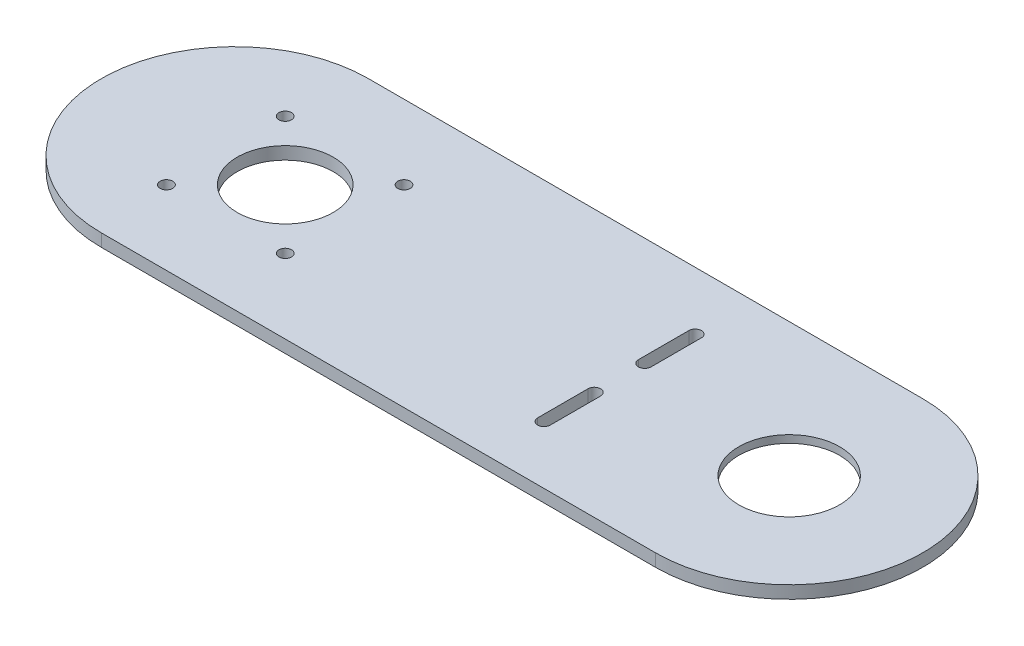
ISO-10303-21;
HEADER;
FILE_DESCRIPTION(('STEP AP214'),'2;1');
FILE_NAME('part.step','',(''),(''),'','','');
FILE_SCHEMA(('AUTOMOTIVE_DESIGN { 1 0 10303 214 1 1 1 1 }'));
ENDSEC;
DATA;
#1=APPLICATION_CONTEXT('core data for automotive mechanical design processes');
#2=APPLICATION_PROTOCOL_DEFINITION('international standard','automotive_design',2000,#1);
#3=PRODUCT_CONTEXT('',#1,'mechanical');
#4=PRODUCT('Part','Part','',(#3));
#5=PRODUCT_RELATED_PRODUCT_CATEGORY('part','',(#4));
#6=PRODUCT_DEFINITION_FORMATION('','',#4);
#7=PRODUCT_DEFINITION_CONTEXT('part definition',#1,'design');
#8=PRODUCT_DEFINITION('design','',#6,#7);
#9=PRODUCT_DEFINITION_SHAPE('','',#8);
#10=(LENGTH_UNIT() NAMED_UNIT(*) SI_UNIT(.MILLI.,.METRE.));
#11=(NAMED_UNIT(*) PLANE_ANGLE_UNIT() SI_UNIT($,.RADIAN.));
#12=(NAMED_UNIT(*) SI_UNIT($,.STERADIAN.) SOLID_ANGLE_UNIT());
#13=UNCERTAINTY_MEASURE_WITH_UNIT(LENGTH_MEASURE(1.E-05),#10,'distance_accuracy_value','');
#14=(GEOMETRIC_REPRESENTATION_CONTEXT(3) GLOBAL_UNCERTAINTY_ASSIGNED_CONTEXT((#13)) GLOBAL_UNIT_ASSIGNED_CONTEXT((#10,
#11,#12)) REPRESENTATION_CONTEXT('',''));
#15=CARTESIAN_POINT('',(0.,0.,0.));
#16=DIRECTION('',(0.,0.,1.));
#17=DIRECTION('',(1.,0.,0.));
#18=AXIS2_PLACEMENT_3D('',#15,#16,#17);
#19=CARTESIAN_POINT('',(110.,0.,0.));
#20=DIRECTION('',(0.,1.,0.));
#21=DIRECTION('',(0.,0.,1.));
#22=AXIS2_PLACEMENT_3D('',#19,#20,#21);
#23=CYLINDRICAL_SURFACE('',#22,20.);
#24=CARTESIAN_POINT('',(110.,5.,0.));
#25=DIRECTION('',(0.,1.,0.));
#26=DIRECTION('',(0.,0.,1.));
#27=AXIS2_PLACEMENT_3D('',#24,#25,#26);
#28=CIRCLE('',#27,20.);
#29=CARTESIAN_POINT('',(110.,5.,20.));
#30=VERTEX_POINT('',#29);
#31=EDGE_CURVE('E207',#30,#30,#28,.T.);
#32=ORIENTED_EDGE('',*,*,#31,.T.);
#33=EDGE_LOOP('',(#32));
#34=FACE_BOUND('',#33,.T.);
#35=CARTESIAN_POINT('',(110.,2.,0.));
#36=DIRECTION('',(0.,-1.,0.));
#37=DIRECTION('',(0.,0.,-1.));
#38=AXIS2_PLACEMENT_3D('',#35,#36,#37);
#39=CIRCLE('',#38,20.);
#40=CARTESIAN_POINT('',(110.,2.,-20.));
#41=VERTEX_POINT('',#40);
#42=EDGE_CURVE('E36',#41,#41,#39,.F.);
#43=ORIENTED_EDGE('',*,*,#42,.F.);
#44=EDGE_LOOP('',(#43));
#45=FACE_BOUND('',#44,.T.);
#46=ADVANCED_FACE('F32',(#34,#45),#23,.F.);
#47=CARTESIAN_POINT('',(-110.,5.,0.));
#48=DIRECTION('',(0.,-1.,0.));
#49=DIRECTION('',(0.,0.,-1.));
#50=AXIS2_PLACEMENT_3D('',#47,#48,#49);
#51=CYLINDRICAL_SURFACE('',#50,53.);
#52=CARTESIAN_POINT('',(-110.,0.,0.));
#53=DIRECTION('',(0.,1.,0.));
#54=DIRECTION('',(0.,0.,1.));
#55=AXIS2_PLACEMENT_3D('',#52,#53,#54);
#56=CIRCLE('',#55,53.);
#57=CARTESIAN_POINT('',(-110.,0.,-53.));
#58=VERTEX_POINT('',#57);
#59=CARTESIAN_POINT('',(-110.,0.,53.));
#60=VERTEX_POINT('',#59);
#61=EDGE_CURVE('E210',#58,#60,#56,.T.);
#62=ORIENTED_EDGE('',*,*,#61,.T.);
#63=DIRECTION('',(0.,-1.,0.));
#64=VECTOR('',#63,1.);
#65=CARTESIAN_POINT('',(-110.,5.,53.));
#66=LINE('',#65,#64);
#67=CARTESIAN_POINT('',(-110.,5.,53.));
#68=VERTEX_POINT('',#67);
#69=EDGE_CURVE('E11',#68,#60,#66,.T.);
#70=ORIENTED_EDGE('',*,*,#69,.F.);
#71=CARTESIAN_POINT('',(-110.,5.,0.));
#72=DIRECTION('',(0.,1.,0.));
#73=DIRECTION('',(0.,0.,1.));
#74=AXIS2_PLACEMENT_3D('',#71,#72,#73);
#75=CIRCLE('',#74,53.);
#76=CARTESIAN_POINT('',(-110.,5.,-53.));
#77=VERTEX_POINT('',#76);
#78=EDGE_CURVE('E211',#77,#68,#75,.T.);
#79=ORIENTED_EDGE('',*,*,#78,.F.);
#80=DIRECTION('',(0.,-1.,0.));
#81=VECTOR('',#80,1.);
#82=CARTESIAN_POINT('',(-110.,5.,-53.));
#83=LINE('',#82,#81);
#84=EDGE_CURVE('E222',#77,#58,#83,.T.);
#85=ORIENTED_EDGE('',*,*,#84,.T.);
#86=EDGE_LOOP('',(#62,#70,#79,#85));
#87=FACE_BOUND('',#86,.T.);
#88=ADVANCED_FACE('F34',(#87),#51,.T.);
#89=CARTESIAN_POINT('',(0.,5.,53.));
#90=DIRECTION('',(0.,0.,-1.));
#91=DIRECTION('',(-1.,0.,0.));
#92=AXIS2_PLACEMENT_3D('',#89,#90,#91);
#93=PLANE('',#92);
#94=DIRECTION('',(1.,0.,0.));
#95=VECTOR('',#94,1.);
#96=CARTESIAN_POINT('',(0.,0.,53.));
#97=LINE('',#96,#95);
#98=CARTESIAN_POINT('',(110.,0.,53.));
#99=VERTEX_POINT('',#98);
#100=EDGE_CURVE('E225',#60,#99,#97,.T.);
#101=ORIENTED_EDGE('',*,*,#100,.T.);
#102=DIRECTION('',(0.,-1.,0.));
#103=VECTOR('',#102,1.);
#104=CARTESIAN_POINT('',(110.,5.,53.));
#105=LINE('',#104,#103);
#106=CARTESIAN_POINT('',(110.,5.,53.));
#107=VERTEX_POINT('',#106);
#108=EDGE_CURVE('E41',#107,#99,#105,.T.);
#109=ORIENTED_EDGE('',*,*,#108,.F.);
#110=DIRECTION('',(1.,0.,0.));
#111=VECTOR('',#110,1.);
#112=CARTESIAN_POINT('',(0.,5.,53.));
#113=LINE('',#112,#111);
#114=EDGE_CURVE('E214',#68,#107,#113,.T.);
#115=ORIENTED_EDGE('',*,*,#114,.F.);
#116=ORIENTED_EDGE('',*,*,#69,.T.);
#117=EDGE_LOOP('',(#101,#109,#115,#116));
#118=FACE_BOUND('',#117,.T.);
#119=ADVANCED_FACE('F253',(#118),#93,.F.);
#120=CARTESIAN_POINT('',(110.,5.,0.));
#121=DIRECTION('',(0.,-1.,0.));
#122=DIRECTION('',(0.,0.,-1.));
#123=AXIS2_PLACEMENT_3D('',#120,#121,#122);
#124=CYLINDRICAL_SURFACE('',#123,53.);
#125=CARTESIAN_POINT('',(110.,0.,0.));
#126=DIRECTION('',(0.,1.,0.));
#127=DIRECTION('',(0.,0.,1.));
#128=AXIS2_PLACEMENT_3D('',#125,#126,#127);
#129=CIRCLE('',#128,53.);
#130=CARTESIAN_POINT('',(110.,0.,-53.));
#131=VERTEX_POINT('',#130);
#132=EDGE_CURVE('E227',#99,#131,#129,.T.);
#133=ORIENTED_EDGE('',*,*,#132,.T.);
#134=DIRECTION('',(0.,-1.,0.));
#135=VECTOR('',#134,1.);
#136=CARTESIAN_POINT('',(110.,5.,-53.));
#137=LINE('',#136,#135);
#138=CARTESIAN_POINT('',(110.,5.,-53.));
#139=VERTEX_POINT('',#138);
#140=EDGE_CURVE('E233',#139,#131,#137,.T.);
#141=ORIENTED_EDGE('',*,*,#140,.F.);
#142=CARTESIAN_POINT('',(110.,5.,0.));
#143=DIRECTION('',(0.,1.,0.));
#144=DIRECTION('',(0.,0.,1.));
#145=AXIS2_PLACEMENT_3D('',#142,#143,#144);
#146=CIRCLE('',#145,53.);
#147=EDGE_CURVE('E217',#107,#139,#146,.T.);
#148=ORIENTED_EDGE('',*,*,#147,.F.);
#149=ORIENTED_EDGE('',*,*,#108,.T.);
#150=EDGE_LOOP('',(#133,#141,#148,#149));
#151=FACE_BOUND('',#150,.T.);
#152=ADVANCED_FACE('F240',(#151),#124,.T.);
#153=CARTESIAN_POINT('',(0.,5.,-53.));
#154=DIRECTION('',(0.,0.,-1.));
#155=DIRECTION('',(-1.,0.,0.));
#156=AXIS2_PLACEMENT_3D('',#153,#154,#155);
#157=PLANE('',#156);
#158=DIRECTION('',(1.,0.,0.));
#159=VECTOR('',#158,1.);
#160=CARTESIAN_POINT('',(0.,0.,-53.));
#161=LINE('',#160,#159);
#162=EDGE_CURVE('E215',#58,#131,#161,.T.);
#163=ORIENTED_EDGE('',*,*,#162,.F.);
#164=ORIENTED_EDGE('',*,*,#84,.F.);
#165=DIRECTION('',(1.,0.,0.));
#166=VECTOR('',#165,1.);
#167=CARTESIAN_POINT('',(0.,5.,-53.));
#168=LINE('',#167,#166);
#169=EDGE_CURVE('E219',#77,#139,#168,.T.);
#170=ORIENTED_EDGE('',*,*,#169,.T.);
#171=ORIENTED_EDGE('',*,*,#140,.T.);
#172=EDGE_LOOP('',(#163,#164,#170,#171));
#173=FACE_BOUND('',#172,.T.);
#174=ADVANCED_FACE('F247',(#173),#157,.T.);
#175=CARTESIAN_POINT('',(0.,5.,0.));
#176=DIRECTION('',(0.,1.,0.));
#177=DIRECTION('',(0.,0.,1.));
#178=AXIS2_PLACEMENT_3D('',#175,#176,#177);
#179=PLANE('',#178);
#180=CARTESIAN_POINT('',(42.6826386405906,5.,10.));
#181=DIRECTION('',(0.,1.,0.));
#182=DIRECTION('',(0.,0.,1.));
#183=AXIS2_PLACEMENT_3D('',#180,#181,#182);
#184=CIRCLE('',#183,2.49999999999999);
#185=CARTESIAN_POINT('',(45.1826386405906,5.,10.));
#186=VERTEX_POINT('',#185);
#187=CARTESIAN_POINT('',(40.1826386405906,5.,10.));
#188=VERTEX_POINT('',#187);
#189=EDGE_CURVE('E48',#186,#188,#184,.T.);
#190=ORIENTED_EDGE('',*,*,#189,.F.);
#191=DIRECTION('',(0.,0.,-1.));
#192=VECTOR('',#191,1.);
#193=CARTESIAN_POINT('',(45.1826386405906,5.,10.));
#194=LINE('',#193,#192);
#195=CARTESIAN_POINT('',(45.1826386405906,5.,30.));
#196=VERTEX_POINT('',#195);
#197=EDGE_CURVE('E169',#196,#186,#194,.T.);
#198=ORIENTED_EDGE('',*,*,#197,.F.);
#199=CARTESIAN_POINT('',(42.6826386405906,5.,30.));
#200=DIRECTION('',(0.,1.,0.));
#201=DIRECTION('',(0.,0.,1.));
#202=AXIS2_PLACEMENT_3D('',#199,#200,#201);
#203=CIRCLE('',#202,2.49999999999999);
#204=CARTESIAN_POINT('',(40.1826386405906,5.,30.));
#205=VERTEX_POINT('',#204);
#206=EDGE_CURVE('E183',#205,#196,#203,.T.);
#207=ORIENTED_EDGE('',*,*,#206,.F.);
#208=DIRECTION('',(0.,0.,1.));
#209=VECTOR('',#208,1.);
#210=CARTESIAN_POINT('',(40.1826386405906,5.,10.));
#211=LINE('',#210,#209);
#212=EDGE_CURVE('E180',#188,#205,#211,.T.);
#213=ORIENTED_EDGE('',*,*,#212,.F.);
#214=EDGE_LOOP('',(#190,#198,#207,#213));
#215=FACE_BOUND('',#214,.T.);
#216=CARTESIAN_POINT('',(42.6826386405906,5.,-30.));
#217=DIRECTION('',(0.,1.,0.));
#218=DIRECTION('',(0.,0.,-1.));
#219=AXIS2_PLACEMENT_3D('',#216,#217,#218);
#220=CIRCLE('',#219,2.49999999999999);
#221=CARTESIAN_POINT('',(45.1826386405906,5.,-30.));
#222=VERTEX_POINT('',#221);
#223=CARTESIAN_POINT('',(40.1826386405906,5.,-30.));
#224=VERTEX_POINT('',#223);
#225=EDGE_CURVE('E56',#222,#224,#220,.T.);
#226=ORIENTED_EDGE('',*,*,#225,.F.);
#227=DIRECTION('',(0.,0.,-1.));
#228=VECTOR('',#227,1.);
#229=CARTESIAN_POINT('',(45.1826386405906,5.,-10.));
#230=LINE('',#229,#228);
#231=CARTESIAN_POINT('',(45.1826386405906,5.,-10.));
#232=VERTEX_POINT('',#231);
#233=EDGE_CURVE('E143',#232,#222,#230,.T.);
#234=ORIENTED_EDGE('',*,*,#233,.F.);
#235=CARTESIAN_POINT('',(42.6826386405906,5.,-10.));
#236=DIRECTION('',(0.,1.,0.));
#237=DIRECTION('',(0.,0.,-1.));
#238=AXIS2_PLACEMENT_3D('',#235,#236,#237);
#239=CIRCLE('',#238,2.49999999999999);
#240=CARTESIAN_POINT('',(40.1826386405906,5.,-10.));
#241=VERTEX_POINT('',#240);
#242=EDGE_CURVE('E146',#241,#232,#239,.T.);
#243=ORIENTED_EDGE('',*,*,#242,.F.);
#244=DIRECTION('',(0.,0.,1.));
#245=VECTOR('',#244,1.);
#246=CARTESIAN_POINT('',(40.1826386405906,5.,-10.));
#247=LINE('',#246,#245);
#248=EDGE_CURVE('E155',#224,#241,#247,.T.);
#249=ORIENTED_EDGE('',*,*,#248,.F.);
#250=EDGE_LOOP('',(#226,#234,#243,#249));
#251=FACE_BOUND('',#250,.T.);
#252=CARTESIAN_POINT('',(-90.,5.,0.));
#253=DIRECTION('',(0.,1.,0.));
#254=DIRECTION('',(0.,0.,1.));
#255=AXIS2_PLACEMENT_3D('',#252,#253,#254);
#256=CIRCLE('',#255,19.05);
#257=CARTESIAN_POINT('',(-90.,5.,19.05));
#258=VERTEX_POINT('',#257);
#259=EDGE_CURVE('E149',#258,#258,#256,.T.);
#260=ORIENTED_EDGE('',*,*,#259,.F.);
#261=EDGE_LOOP('',(#260));
#262=FACE_BOUND('',#261,.T.);
#263=CARTESIAN_POINT('',(-113.57,5.,23.57));
#264=DIRECTION('',(0.,1.,0.));
#265=DIRECTION('',(0.,0.,1.));
#266=AXIS2_PLACEMENT_3D('',#263,#264,#265);
#267=CIRCLE('',#266,2.50000000000001);
#268=CARTESIAN_POINT('',(-113.57,5.,26.07));
#269=VERTEX_POINT('',#268);
#270=EDGE_CURVE('E486',#269,#269,#267,.T.);
#271=ORIENTED_EDGE('',*,*,#270,.F.);
#272=EDGE_LOOP('',(#271));
#273=FACE_BOUND('',#272,.T.);
#274=CARTESIAN_POINT('',(-66.43,5.,23.57));
#275=DIRECTION('',(0.,1.,0.));
#276=DIRECTION('',(0.,0.,1.));
#277=AXIS2_PLACEMENT_3D('',#274,#275,#276);
#278=CIRCLE('',#277,2.5);
#279=CARTESIAN_POINT('',(-66.43,5.,26.07));
#280=VERTEX_POINT('',#279);
#281=EDGE_CURVE('E490',#280,#280,#278,.T.);
#282=ORIENTED_EDGE('',*,*,#281,.F.);
#283=EDGE_LOOP('',(#282));
#284=FACE_BOUND('',#283,.T.);
#285=CARTESIAN_POINT('',(-66.43,5.,-23.57));
#286=DIRECTION('',(0.,1.,0.));
#287=DIRECTION('',(0.,0.,1.));
#288=AXIS2_PLACEMENT_3D('',#285,#286,#287);
#289=CIRCLE('',#288,2.50000000000001);
#290=CARTESIAN_POINT('',(-66.43,5.,-21.07));
#291=VERTEX_POINT('',#290);
#292=EDGE_CURVE('E494',#291,#291,#289,.T.);
#293=ORIENTED_EDGE('',*,*,#292,.F.);
#294=EDGE_LOOP('',(#293));
#295=FACE_BOUND('',#294,.T.);
#296=CARTESIAN_POINT('',(-113.57,5.,-23.57));
#297=DIRECTION('',(0.,1.,0.));
#298=DIRECTION('',(0.,0.,1.));
#299=AXIS2_PLACEMENT_3D('',#296,#297,#298);
#300=CIRCLE('',#299,2.50000000000001);
#301=CARTESIAN_POINT('',(-113.57,5.,-21.07));
#302=VERTEX_POINT('',#301);
#303=EDGE_CURVE('E198',#302,#302,#300,.T.);
#304=ORIENTED_EDGE('',*,*,#303,.F.);
#305=EDGE_LOOP('',(#304));
#306=FACE_BOUND('',#305,.T.);
#307=ORIENTED_EDGE('',*,*,#31,.F.);
#308=EDGE_LOOP('',(#307));
#309=FACE_BOUND('',#308,.T.);
#310=ORIENTED_EDGE('',*,*,#78,.T.);
#311=ORIENTED_EDGE('',*,*,#114,.T.);
#312=ORIENTED_EDGE('',*,*,#147,.T.);
#313=ORIENTED_EDGE('',*,*,#169,.F.);
#314=EDGE_LOOP('',(#310,#311,#312,#313));
#315=FACE_BOUND('',#314,.T.);
#316=ADVANCED_FACE('F251',(#215,#251,#262,#273,#284,#295,#306,#309,#315),#179,.T.);
#317=CARTESIAN_POINT('',(0.,0.,0.));
#318=DIRECTION('',(0.,1.,0.));
#319=DIRECTION('',(0.,0.,1.));
#320=AXIS2_PLACEMENT_3D('',#317,#318,#319);
#321=PLANE('',#320);
#322=DIRECTION('',(0.,0.,-1.));
#323=VECTOR('',#322,1.);
#324=CARTESIAN_POINT('',(45.1826386405906,0.,10.));
#325=LINE('',#324,#323);
#326=CARTESIAN_POINT('',(45.1826386405906,0.,30.));
#327=VERTEX_POINT('',#326);
#328=CARTESIAN_POINT('',(45.1826386405906,0.,10.));
#329=VERTEX_POINT('',#328);
#330=EDGE_CURVE('E175',#327,#329,#325,.T.);
#331=ORIENTED_EDGE('',*,*,#330,.T.);
#332=CARTESIAN_POINT('',(42.6826386405906,0.,10.));
#333=DIRECTION('',(0.,1.,0.));
#334=DIRECTION('',(0.,0.,1.));
#335=AXIS2_PLACEMENT_3D('',#332,#333,#334);
#336=CIRCLE('',#335,2.49999999999999);
#337=CARTESIAN_POINT('',(40.1826386405906,0.,10.));
#338=VERTEX_POINT('',#337);
#339=EDGE_CURVE('E165',#329,#338,#336,.T.);
#340=ORIENTED_EDGE('',*,*,#339,.T.);
#341=DIRECTION('',(0.,0.,1.));
#342=VECTOR('',#341,1.);
#343=CARTESIAN_POINT('',(40.1826386405906,0.,10.));
#344=LINE('',#343,#342);
#345=CARTESIAN_POINT('',(40.1826386405906,0.,30.));
#346=VERTEX_POINT('',#345);
#347=EDGE_CURVE('E168',#338,#346,#344,.T.);
#348=ORIENTED_EDGE('',*,*,#347,.T.);
#349=CARTESIAN_POINT('',(42.6826386405906,0.,30.));
#350=DIRECTION('',(0.,1.,0.));
#351=DIRECTION('',(0.,0.,1.));
#352=AXIS2_PLACEMENT_3D('',#349,#350,#351);
#353=CIRCLE('',#352,2.49999999999999);
#354=EDGE_CURVE('E172',#346,#327,#353,.T.);
#355=ORIENTED_EDGE('',*,*,#354,.T.);
#356=EDGE_LOOP('',(#331,#340,#348,#355));
#357=FACE_BOUND('',#356,.T.);
#358=DIRECTION('',(0.,0.,-1.));
#359=VECTOR('',#358,1.);
#360=CARTESIAN_POINT('',(45.1826386405906,0.,-10.));
#361=LINE('',#360,#359);
#362=CARTESIAN_POINT('',(45.1826386405906,0.,-10.));
#363=VERTEX_POINT('',#362);
#364=CARTESIAN_POINT('',(45.1826386405906,0.,-30.));
#365=VERTEX_POINT('',#364);
#366=EDGE_CURVE('E130',#363,#365,#361,.T.);
#367=ORIENTED_EDGE('',*,*,#366,.T.);
#368=CARTESIAN_POINT('',(42.6826386405906,0.,-30.));
#369=DIRECTION('',(0.,1.,0.));
#370=DIRECTION('',(0.,0.,-1.));
#371=AXIS2_PLACEMENT_3D('',#368,#369,#370);
#372=CIRCLE('',#371,2.49999999999999);
#373=CARTESIAN_POINT('',(40.1826386405906,0.,-30.));
#374=VERTEX_POINT('',#373);
#375=EDGE_CURVE('E124',#365,#374,#372,.T.);
#376=ORIENTED_EDGE('',*,*,#375,.T.);
#377=DIRECTION('',(0.,0.,1.));
#378=VECTOR('',#377,1.);
#379=CARTESIAN_POINT('',(40.1826386405906,0.,-10.));
#380=LINE('',#379,#378);
#381=CARTESIAN_POINT('',(40.1826386405906,0.,-10.));
#382=VERTEX_POINT('',#381);
#383=EDGE_CURVE('E134',#374,#382,#380,.T.);
#384=ORIENTED_EDGE('',*,*,#383,.T.);
#385=CARTESIAN_POINT('',(42.6826386405906,0.,-10.));
#386=DIRECTION('',(0.,1.,0.));
#387=DIRECTION('',(0.,0.,-1.));
#388=AXIS2_PLACEMENT_3D('',#385,#386,#387);
#389=CIRCLE('',#388,2.49999999999999);
#390=EDGE_CURVE('E138',#382,#363,#389,.T.);
#391=ORIENTED_EDGE('',*,*,#390,.T.);
#392=EDGE_LOOP('',(#367,#376,#384,#391));
#393=FACE_BOUND('',#392,.T.);
#394=CARTESIAN_POINT('',(-90.,0.,0.));
#395=DIRECTION('',(0.,1.,0.));
#396=DIRECTION('',(0.,0.,1.));
#397=AXIS2_PLACEMENT_3D('',#394,#395,#396);
#398=CIRCLE('',#397,19.05);
#399=CARTESIAN_POINT('',(-90.,0.,19.05));
#400=VERTEX_POINT('',#399);
#401=EDGE_CURVE('E511',#400,#400,#398,.T.);
#402=ORIENTED_EDGE('',*,*,#401,.T.);
#403=EDGE_LOOP('',(#402));
#404=FACE_BOUND('',#403,.T.);
#405=CARTESIAN_POINT('',(-113.57,0.,23.57));
#406=DIRECTION('',(0.,1.,0.));
#407=DIRECTION('',(0.,0.,1.));
#408=AXIS2_PLACEMENT_3D('',#405,#406,#407);
#409=CIRCLE('',#408,2.50000000000001);
#410=CARTESIAN_POINT('',(-113.57,0.,26.07));
#411=VERTEX_POINT('',#410);
#412=EDGE_CURVE('E508',#411,#411,#409,.T.);
#413=ORIENTED_EDGE('',*,*,#412,.T.);
#414=EDGE_LOOP('',(#413));
#415=FACE_BOUND('',#414,.T.);
#416=CARTESIAN_POINT('',(-66.43,0.,23.57));
#417=DIRECTION('',(0.,1.,0.));
#418=DIRECTION('',(0.,0.,1.));
#419=AXIS2_PLACEMENT_3D('',#416,#417,#418);
#420=CIRCLE('',#419,2.5);
#421=CARTESIAN_POINT('',(-66.43,0.,26.07));
#422=VERTEX_POINT('',#421);
#423=EDGE_CURVE('E500',#422,#422,#420,.T.);
#424=ORIENTED_EDGE('',*,*,#423,.T.);
#425=EDGE_LOOP('',(#424));
#426=FACE_BOUND('',#425,.T.);
#427=CARTESIAN_POINT('',(-66.43,0.,-23.57));
#428=DIRECTION('',(0.,1.,0.));
#429=DIRECTION('',(0.,0.,1.));
#430=AXIS2_PLACEMENT_3D('',#427,#428,#429);
#431=CIRCLE('',#430,2.50000000000001);
#432=CARTESIAN_POINT('',(-66.43,0.,-21.07));
#433=VERTEX_POINT('',#432);
#434=EDGE_CURVE('E201',#433,#433,#431,.T.);
#435=ORIENTED_EDGE('',*,*,#434,.T.);
#436=EDGE_LOOP('',(#435));
#437=FACE_BOUND('',#436,.T.);
#438=CARTESIAN_POINT('',(-113.57,0.,-23.57));
#439=DIRECTION('',(0.,1.,0.));
#440=DIRECTION('',(0.,0.,1.));
#441=AXIS2_PLACEMENT_3D('',#438,#439,#440);
#442=CIRCLE('',#441,2.50000000000001);
#443=CARTESIAN_POINT('',(-113.57,0.,-21.07));
#444=VERTEX_POINT('',#443);
#445=EDGE_CURVE('E194',#444,#444,#442,.T.);
#446=ORIENTED_EDGE('',*,*,#445,.T.);
#447=EDGE_LOOP('',(#446));
#448=FACE_BOUND('',#447,.T.);
#449=CARTESIAN_POINT('',(110.,0.,0.));
#450=DIRECTION('',(0.,-1.,0.));
#451=DIRECTION('',(0.,0.,-1.));
#452=AXIS2_PLACEMENT_3D('',#449,#450,#451);
#453=CIRCLE('',#452,30.);
#454=CARTESIAN_POINT('',(110.,0.,-30.));
#455=VERTEX_POINT('',#454);
#456=EDGE_CURVE('E197',#455,#455,#453,.T.);
#457=ORIENTED_EDGE('',*,*,#456,.F.);
#458=EDGE_LOOP('',(#457));
#459=FACE_BOUND('',#458,.T.);
#460=ORIENTED_EDGE('',*,*,#61,.F.);
#461=ORIENTED_EDGE('',*,*,#162,.T.);
#462=ORIENTED_EDGE('',*,*,#132,.F.);
#463=ORIENTED_EDGE('',*,*,#100,.F.);
#464=EDGE_LOOP('',(#460,#461,#462,#463));
#465=FACE_BOUND('',#464,.T.);
#466=ADVANCED_FACE('F140',(#357,#393,#404,#415,#426,#437,#448,#459,#465),#321,.F.);
#467=CARTESIAN_POINT('',(110.,2.,0.));
#468=DIRECTION('',(0.,-1.,0.));
#469=DIRECTION('',(0.,0.,-1.));
#470=AXIS2_PLACEMENT_3D('',#467,#468,#469);
#471=PLANE('',#470);
#472=CARTESIAN_POINT('',(110.,2.,0.));
#473=DIRECTION('',(0.,-1.,0.));
#474=DIRECTION('',(0.,0.,-1.));
#475=AXIS2_PLACEMENT_3D('',#472,#473,#474);
#476=CIRCLE('',#475,30.);
#477=CARTESIAN_POINT('',(110.,2.,-30.));
#478=VERTEX_POINT('',#477);
#479=EDGE_CURVE('E202',#478,#478,#476,.T.);
#480=ORIENTED_EDGE('',*,*,#479,.T.);
#481=EDGE_LOOP('',(#480));
#482=FACE_BOUND('',#481,.T.);
#483=ORIENTED_EDGE('',*,*,#42,.T.);
#484=EDGE_LOOP('',(#483));
#485=FACE_BOUND('',#484,.T.);
#486=ADVANCED_FACE('F274',(#482,#485),#471,.T.);
#487=CARTESIAN_POINT('',(110.,2.,0.));
#488=DIRECTION('',(0.,-1.,0.));
#489=DIRECTION('',(0.,0.,-1.));
#490=AXIS2_PLACEMENT_3D('',#487,#488,#489);
#491=CYLINDRICAL_SURFACE('',#490,30.);
#492=ORIENTED_EDGE('',*,*,#479,.F.);
#493=EDGE_LOOP('',(#492));
#494=FACE_BOUND('',#493,.T.);
#495=ORIENTED_EDGE('',*,*,#456,.T.);
#496=EDGE_LOOP('',(#495));
#497=FACE_BOUND('',#496,.T.);
#498=ADVANCED_FACE('F267',(#494,#497),#491,.F.);
#499=CARTESIAN_POINT('',(-113.57,0.,-23.57));
#500=DIRECTION('',(0.,1.,0.));
#501=DIRECTION('',(0.,0.,1.));
#502=AXIS2_PLACEMENT_3D('',#499,#500,#501);
#503=CYLINDRICAL_SURFACE('',#502,2.50000000000001);
#504=ORIENTED_EDGE('',*,*,#445,.F.);
#505=EDGE_LOOP('',(#504));
#506=FACE_BOUND('',#505,.T.);
#507=ORIENTED_EDGE('',*,*,#303,.T.);
#508=EDGE_LOOP('',(#507));
#509=FACE_BOUND('',#508,.T.);
#510=ADVANCED_FACE('F308',(#506,#509),#503,.F.);
#511=CARTESIAN_POINT('',(-66.43,0.,-23.57));
#512=DIRECTION('',(0.,1.,0.));
#513=DIRECTION('',(0.,0.,1.));
#514=AXIS2_PLACEMENT_3D('',#511,#512,#513);
#515=CYLINDRICAL_SURFACE('',#514,2.50000000000001);
#516=ORIENTED_EDGE('',*,*,#434,.F.);
#517=EDGE_LOOP('',(#516));
#518=FACE_BOUND('',#517,.T.);
#519=ORIENTED_EDGE('',*,*,#292,.T.);
#520=EDGE_LOOP('',(#519));
#521=FACE_BOUND('',#520,.T.);
#522=ADVANCED_FACE('F314',(#518,#521),#515,.F.);
#523=CARTESIAN_POINT('',(-66.43,0.,23.57));
#524=DIRECTION('',(0.,1.,0.));
#525=DIRECTION('',(0.,0.,1.));
#526=AXIS2_PLACEMENT_3D('',#523,#524,#525);
#527=CYLINDRICAL_SURFACE('',#526,2.5);
#528=ORIENTED_EDGE('',*,*,#423,.F.);
#529=EDGE_LOOP('',(#528));
#530=FACE_BOUND('',#529,.T.);
#531=ORIENTED_EDGE('',*,*,#281,.T.);
#532=EDGE_LOOP('',(#531));
#533=FACE_BOUND('',#532,.T.);
#534=ADVANCED_FACE('F322',(#530,#533),#527,.F.);
#535=CARTESIAN_POINT('',(-113.57,0.,23.57));
#536=DIRECTION('',(0.,1.,0.));
#537=DIRECTION('',(0.,0.,1.));
#538=AXIS2_PLACEMENT_3D('',#535,#536,#537);
#539=CYLINDRICAL_SURFACE('',#538,2.50000000000001);
#540=ORIENTED_EDGE('',*,*,#412,.F.);
#541=EDGE_LOOP('',(#540));
#542=FACE_BOUND('',#541,.T.);
#543=ORIENTED_EDGE('',*,*,#270,.T.);
#544=EDGE_LOOP('',(#543));
#545=FACE_BOUND('',#544,.T.);
#546=ADVANCED_FACE('F330',(#542,#545),#539,.F.);
#547=CARTESIAN_POINT('',(-90.,0.,0.));
#548=DIRECTION('',(0.,1.,0.));
#549=DIRECTION('',(0.,0.,1.));
#550=AXIS2_PLACEMENT_3D('',#547,#548,#549);
#551=CYLINDRICAL_SURFACE('',#550,19.05);
#552=ORIENTED_EDGE('',*,*,#401,.F.);
#553=EDGE_LOOP('',(#552));
#554=FACE_BOUND('',#553,.T.);
#555=ORIENTED_EDGE('',*,*,#259,.T.);
#556=EDGE_LOOP('',(#555));
#557=FACE_BOUND('',#556,.T.);
#558=ADVANCED_FACE('F338',(#554,#557),#551,.F.);
#559=CARTESIAN_POINT('',(42.6826386405906,0.,-30.));
#560=DIRECTION('',(0.,1.,0.));
#561=DIRECTION('',(0.,0.,1.));
#562=AXIS2_PLACEMENT_3D('',#559,#560,#561);
#563=CYLINDRICAL_SURFACE('',#562,2.49999999999999);
#564=ORIENTED_EDGE('',*,*,#225,.T.);
#565=DIRECTION('',(0.,1.,0.));
#566=VECTOR('',#565,1.);
#567=CARTESIAN_POINT('',(40.1826386405906,0.,-30.));
#568=LINE('',#567,#566);
#569=EDGE_CURVE('E120',#374,#224,#568,.T.);
#570=ORIENTED_EDGE('',*,*,#569,.F.);
#571=ORIENTED_EDGE('',*,*,#375,.F.);
#572=DIRECTION('',(0.,1.,0.));
#573=VECTOR('',#572,1.);
#574=CARTESIAN_POINT('',(45.1826386405906,0.,-30.));
#575=LINE('',#574,#573);
#576=EDGE_CURVE('E160',#365,#222,#575,.T.);
#577=ORIENTED_EDGE('',*,*,#576,.T.);
#578=EDGE_LOOP('',(#564,#570,#571,#577));
#579=FACE_BOUND('',#578,.T.);
#580=ADVANCED_FACE('F122',(#579),#563,.F.);
#581=CARTESIAN_POINT('',(45.1826386405906,0.,-10.));
#582=DIRECTION('',(1.,0.,0.));
#583=DIRECTION('',(0.,0.,-1.));
#584=AXIS2_PLACEMENT_3D('',#581,#582,#583);
#585=PLANE('',#584);
#586=ORIENTED_EDGE('',*,*,#233,.T.);
#587=ORIENTED_EDGE('',*,*,#576,.F.);
#588=ORIENTED_EDGE('',*,*,#366,.F.);
#589=DIRECTION('',(0.,1.,0.));
#590=VECTOR('',#589,1.);
#591=CARTESIAN_POINT('',(45.1826386405906,0.,-10.));
#592=LINE('',#591,#590);
#593=EDGE_CURVE('E162',#363,#232,#592,.T.);
#594=ORIENTED_EDGE('',*,*,#593,.T.);
#595=EDGE_LOOP('',(#586,#587,#588,#594));
#596=FACE_BOUND('',#595,.T.);
#597=ADVANCED_FACE('F353',(#596),#585,.F.);
#598=CARTESIAN_POINT('',(42.6826386405906,0.,-10.));
#599=DIRECTION('',(0.,1.,0.));
#600=DIRECTION('',(0.,0.,1.));
#601=AXIS2_PLACEMENT_3D('',#598,#599,#600);
#602=CYLINDRICAL_SURFACE('',#601,2.49999999999999);
#603=ORIENTED_EDGE('',*,*,#242,.T.);
#604=ORIENTED_EDGE('',*,*,#593,.F.);
#605=ORIENTED_EDGE('',*,*,#390,.F.);
#606=DIRECTION('',(0.,1.,0.));
#607=VECTOR('',#606,1.);
#608=CARTESIAN_POINT('',(40.1826386405906,0.,-10.));
#609=LINE('',#608,#607);
#610=EDGE_CURVE('E129',#382,#241,#609,.T.);
#611=ORIENTED_EDGE('',*,*,#610,.T.);
#612=EDGE_LOOP('',(#603,#604,#605,#611));
#613=FACE_BOUND('',#612,.T.);
#614=ADVANCED_FACE('F360',(#613),#602,.F.);
#615=CARTESIAN_POINT('',(40.1826386405906,0.,-10.));
#616=DIRECTION('',(-1.,0.,0.));
#617=DIRECTION('',(0.,0.,1.));
#618=AXIS2_PLACEMENT_3D('',#615,#616,#617);
#619=PLANE('',#618);
#620=ORIENTED_EDGE('',*,*,#248,.T.);
#621=ORIENTED_EDGE('',*,*,#610,.F.);
#622=ORIENTED_EDGE('',*,*,#383,.F.);
#623=ORIENTED_EDGE('',*,*,#569,.T.);
#624=EDGE_LOOP('',(#620,#621,#622,#623));
#625=FACE_BOUND('',#624,.T.);
#626=ADVANCED_FACE('F135',(#625),#619,.F.);
#627=CARTESIAN_POINT('',(42.6826386405906,0.,10.));
#628=DIRECTION('',(0.,1.,0.));
#629=DIRECTION('',(0.,0.,1.));
#630=AXIS2_PLACEMENT_3D('',#627,#628,#629);
#631=CYLINDRICAL_SURFACE('',#630,2.49999999999999);
#632=ORIENTED_EDGE('',*,*,#189,.T.);
#633=DIRECTION('',(0.,1.,0.));
#634=VECTOR('',#633,1.);
#635=CARTESIAN_POINT('',(40.1826386405906,0.,10.));
#636=LINE('',#635,#634);
#637=EDGE_CURVE('E178',#338,#188,#636,.T.);
#638=ORIENTED_EDGE('',*,*,#637,.F.);
#639=ORIENTED_EDGE('',*,*,#339,.F.);
#640=DIRECTION('',(0.,1.,0.));
#641=VECTOR('',#640,1.);
#642=CARTESIAN_POINT('',(45.1826386405906,0.,10.));
#643=LINE('',#642,#641);
#644=EDGE_CURVE('E156',#329,#186,#643,.T.);
#645=ORIENTED_EDGE('',*,*,#644,.T.);
#646=EDGE_LOOP('',(#632,#638,#639,#645));
#647=FACE_BOUND('',#646,.T.);
#648=ADVANCED_FACE('F375',(#647),#631,.F.);
#649=CARTESIAN_POINT('',(45.1826386405906,0.,10.));
#650=DIRECTION('',(1.,0.,0.));
#651=DIRECTION('',(0.,0.,-1.));
#652=AXIS2_PLACEMENT_3D('',#649,#650,#651);
#653=PLANE('',#652);
#654=ORIENTED_EDGE('',*,*,#197,.T.);
#655=ORIENTED_EDGE('',*,*,#644,.F.);
#656=ORIENTED_EDGE('',*,*,#330,.F.);
#657=DIRECTION('',(0.,1.,0.));
#658=VECTOR('',#657,1.);
#659=CARTESIAN_POINT('',(45.1826386405906,0.,30.));
#660=LINE('',#659,#658);
#661=EDGE_CURVE('E189',#327,#196,#660,.T.);
#662=ORIENTED_EDGE('',*,*,#661,.T.);
#663=EDGE_LOOP('',(#654,#655,#656,#662));
#664=FACE_BOUND('',#663,.T.);
#665=ADVANCED_FACE('F382',(#664),#653,.F.);
#666=CARTESIAN_POINT('',(42.6826386405906,0.,30.));
#667=DIRECTION('',(0.,1.,0.));
#668=DIRECTION('',(0.,0.,1.));
#669=AXIS2_PLACEMENT_3D('',#666,#667,#668);
#670=CYLINDRICAL_SURFACE('',#669,2.49999999999999);
#671=ORIENTED_EDGE('',*,*,#206,.T.);
#672=ORIENTED_EDGE('',*,*,#661,.F.);
#673=ORIENTED_EDGE('',*,*,#354,.F.);
#674=DIRECTION('',(0.,1.,0.));
#675=VECTOR('',#674,1.);
#676=CARTESIAN_POINT('',(40.1826386405906,0.,30.));
#677=LINE('',#676,#675);
#678=EDGE_CURVE('E191',#346,#205,#677,.T.);
#679=ORIENTED_EDGE('',*,*,#678,.T.);
#680=EDGE_LOOP('',(#671,#672,#673,#679));
#681=FACE_BOUND('',#680,.T.);
#682=ADVANCED_FACE('F389',(#681),#670,.F.);
#683=CARTESIAN_POINT('',(40.1826386405906,0.,10.));
#684=DIRECTION('',(-1.,0.,0.));
#685=DIRECTION('',(0.,0.,1.));
#686=AXIS2_PLACEMENT_3D('',#683,#684,#685);
#687=PLANE('',#686);
#688=ORIENTED_EDGE('',*,*,#212,.T.);
#689=ORIENTED_EDGE('',*,*,#678,.F.);
#690=ORIENTED_EDGE('',*,*,#347,.F.);
#691=ORIENTED_EDGE('',*,*,#637,.T.);
#692=EDGE_LOOP('',(#688,#689,#690,#691));
#693=FACE_BOUND('',#692,.T.);
#694=ADVANCED_FACE('F397',(#693),#687,.F.);
#695=CLOSED_SHELL('',(#46,#88,#119,#152,#174,#316,#466,#486,#498,#510,#522,#534,#546,#558,#580,
#597,#614,#626,#648,#665,#682,#694));
#696=MANIFOLD_SOLID_BREP('B2',#695);
#697=ADVANCED_BREP_SHAPE_REPRESENTATION('',(#18,#696),#14);
#698=SHAPE_DEFINITION_REPRESENTATION(#9,#697);
ENDSEC;
END-ISO-10303-21;
